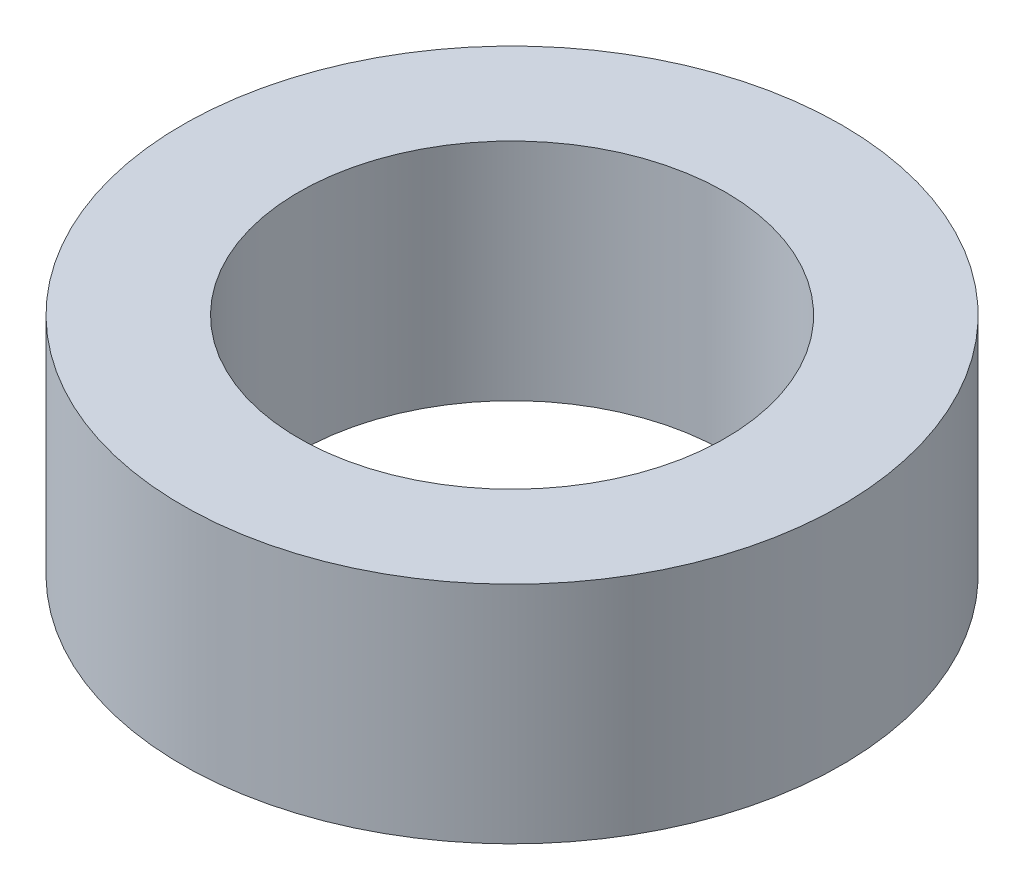
ISO-10303-21;
HEADER;
FILE_DESCRIPTION(('STEP AP214'),'2;1');
FILE_NAME('part.step','',(''),(''),'','','');
FILE_SCHEMA(('AUTOMOTIVE_DESIGN { 1 0 10303 214 1 1 1 1 }'));
ENDSEC;
DATA;
#1=APPLICATION_CONTEXT('core data for automotive mechanical design processes');
#2=APPLICATION_PROTOCOL_DEFINITION('international standard','automotive_design',2000,#1);
#3=PRODUCT_CONTEXT('',#1,'mechanical');
#4=PRODUCT('Part','Part','',(#3));
#5=PRODUCT_RELATED_PRODUCT_CATEGORY('part','',(#4));
#6=PRODUCT_DEFINITION_FORMATION('','',#4);
#7=PRODUCT_DEFINITION_CONTEXT('part definition',#1,'design');
#8=PRODUCT_DEFINITION('design','',#6,#7);
#9=PRODUCT_DEFINITION_SHAPE('','',#8);
#10=(LENGTH_UNIT() NAMED_UNIT(*) SI_UNIT(.MILLI.,.METRE.));
#11=(NAMED_UNIT(*) PLANE_ANGLE_UNIT() SI_UNIT($,.RADIAN.));
#12=(NAMED_UNIT(*) SI_UNIT($,.STERADIAN.) SOLID_ANGLE_UNIT());
#13=UNCERTAINTY_MEASURE_WITH_UNIT(LENGTH_MEASURE(1.E-05),#10,'distance_accuracy_value','');
#14=(GEOMETRIC_REPRESENTATION_CONTEXT(3) GLOBAL_UNCERTAINTY_ASSIGNED_CONTEXT((#13)) GLOBAL_UNIT_ASSIGNED_CONTEXT((#10,
#11,#12)) REPRESENTATION_CONTEXT('',''));
#15=CARTESIAN_POINT('',(0.,0.,0.));
#16=DIRECTION('',(0.,0.,1.));
#17=DIRECTION('',(1.,0.,0.));
#18=AXIS2_PLACEMENT_3D('',#15,#16,#17);
#19=CARTESIAN_POINT('',(0.,29.,0.));
#20=DIRECTION('',(0.,-1.,0.));
#21=DIRECTION('',(0.,0.,-1.));
#22=AXIS2_PLACEMENT_3D('',#19,#20,#21);
#23=CYLINDRICAL_SURFACE('',#22,42.5);
#24=CARTESIAN_POINT('',(0.,29.,0.));
#25=DIRECTION('',(0.,1.,0.));
#26=DIRECTION('',(0.,0.,1.));
#27=AXIS2_PLACEMENT_3D('',#24,#25,#26);
#28=CIRCLE('',#27,42.5);
#29=CARTESIAN_POINT('',(0.,29.,-42.5));
#30=VERTEX_POINT('',#29);
#31=EDGE_CURVE('E10',#30,#30,#28,.T.);
#32=CARTESIAN_POINT('',(0.,0.,0.));
#33=DIRECTION('',(0.,1.,0.));
#34=DIRECTION('',(0.,0.,1.));
#35=AXIS2_PLACEMENT_3D('',#32,#33,#34);
#36=CIRCLE('',#35,42.5);
#37=CARTESIAN_POINT('',(0.,0.,-42.5));
#38=VERTEX_POINT('',#37);
#39=EDGE_CURVE('E37',#38,#38,#36,.T.);
#40=CARTESIAN_POINT('',(0.,29.,-42.5));
#41=CARTESIAN_POINT('',(0.,28.6979166666667,-42.5));
#42=CARTESIAN_POINT('',(0.,28.3958333333333,-42.5));
#43=CARTESIAN_POINT('',(0.,27.7916666666667,-42.5));
#44=CARTESIAN_POINT('',(0.,27.4895833333333,-42.5));
#45=CARTESIAN_POINT('',(0.,26.8854166666667,-42.5));
#46=CARTESIAN_POINT('',(0.,26.5833333333333,-42.5));
#47=CARTESIAN_POINT('',(0.,25.9791666666667,-42.5));
#48=CARTESIAN_POINT('',(0.,25.6770833333333,-42.5));
#49=CARTESIAN_POINT('',(0.,25.0729166666667,-42.5));
#50=CARTESIAN_POINT('',(0.,24.7708333333333,-42.5));
#51=CARTESIAN_POINT('',(0.,24.1666666666667,-42.5));
#52=CARTESIAN_POINT('',(0.,23.8645833333333,-42.5));
#53=CARTESIAN_POINT('',(0.,23.2604166666667,-42.5));
#54=CARTESIAN_POINT('',(0.,22.9583333333333,-42.5));
#55=CARTESIAN_POINT('',(0.,22.3541666666667,-42.5));
#56=CARTESIAN_POINT('',(0.,22.0520833333333,-42.5));
#57=CARTESIAN_POINT('',(0.,21.4479166666667,-42.5));
#58=CARTESIAN_POINT('',(0.,21.1458333333333,-42.5));
#59=CARTESIAN_POINT('',(0.,20.5416666666667,-42.5));
#60=CARTESIAN_POINT('',(0.,20.2395833333333,-42.5));
#61=CARTESIAN_POINT('',(0.,19.6354166666667,-42.5));
#62=CARTESIAN_POINT('',(0.,19.3333333333333,-42.5));
#63=CARTESIAN_POINT('',(0.,18.7291666666667,-42.5));
#64=CARTESIAN_POINT('',(0.,18.4270833333333,-42.5));
#65=CARTESIAN_POINT('',(0.,17.8229166666667,-42.5));
#66=CARTESIAN_POINT('',(0.,17.5208333333333,-42.5));
#67=CARTESIAN_POINT('',(0.,16.9166666666667,-42.5));
#68=CARTESIAN_POINT('',(0.,16.6145833333333,-42.5));
#69=CARTESIAN_POINT('',(0.,16.0104166666667,-42.5));
#70=CARTESIAN_POINT('',(0.,15.7083333333333,-42.5));
#71=CARTESIAN_POINT('',(0.,15.1041666666667,-42.5));
#72=CARTESIAN_POINT('',(0.,14.8020833333333,-42.5));
#73=CARTESIAN_POINT('',(0.,14.1979166666667,-42.5));
#74=CARTESIAN_POINT('',(0.,13.8958333333333,-42.5));
#75=CARTESIAN_POINT('',(0.,13.2916666666667,-42.5));
#76=CARTESIAN_POINT('',(0.,12.9895833333333,-42.5));
#77=CARTESIAN_POINT('',(0.,12.3854166666667,-42.5));
#78=CARTESIAN_POINT('',(0.,12.0833333333333,-42.5));
#79=CARTESIAN_POINT('',(0.,11.4791666666667,-42.5));
#80=CARTESIAN_POINT('',(0.,11.1770833333333,-42.5));
#81=CARTESIAN_POINT('',(0.,10.5729166666667,-42.5));
#82=CARTESIAN_POINT('',(0.,10.2708333333333,-42.5));
#83=CARTESIAN_POINT('',(0.,9.66666666666667,-42.5));
#84=CARTESIAN_POINT('',(0.,9.36458333333333,-42.5));
#85=CARTESIAN_POINT('',(0.,8.76041666666667,-42.5));
#86=CARTESIAN_POINT('',(0.,8.45833333333333,-42.5));
#87=CARTESIAN_POINT('',(0.,7.85416666666667,-42.5));
#88=CARTESIAN_POINT('',(0.,7.55208333333333,-42.5));
#89=CARTESIAN_POINT('',(0.,6.94791666666667,-42.5));
#90=CARTESIAN_POINT('',(0.,6.64583333333333,-42.5));
#91=CARTESIAN_POINT('',(0.,6.04166666666667,-42.5));
#92=CARTESIAN_POINT('',(0.,5.73958333333333,-42.5));
#93=CARTESIAN_POINT('',(0.,5.13541666666667,-42.5));
#94=CARTESIAN_POINT('',(0.,4.83333333333333,-42.5));
#95=CARTESIAN_POINT('',(0.,4.22916666666667,-42.5));
#96=CARTESIAN_POINT('',(0.,3.92708333333333,-42.5));
#97=CARTESIAN_POINT('',(0.,3.32291666666667,-42.5));
#98=CARTESIAN_POINT('',(0.,3.02083333333333,-42.5));
#99=CARTESIAN_POINT('',(0.,2.41666666666667,-42.5));
#100=CARTESIAN_POINT('',(0.,2.11458333333333,-42.5));
#101=CARTESIAN_POINT('',(0.,1.51041666666667,-42.5));
#102=CARTESIAN_POINT('',(0.,1.20833333333333,-42.5));
#103=CARTESIAN_POINT('',(0.,0.604166666666667,-42.5));
#104=CARTESIAN_POINT('',(0.,0.302083333333333,-42.5));
#105=CARTESIAN_POINT('',(0.,0.,-42.5));
#106=B_SPLINE_CURVE_WITH_KNOTS('',3,(#40,#41,#42,#43,#44,#45,#46,#47,#48,#49,#50,#51,#52,#53,
#54,#55,#56,#57,#58,#59,#60,#61,#62,#63,#64,#65,#66,#67,#68,#69,#70,#71,#72,#73,#74,#75,#76,#77,
#78,#79,#80,#81,#82,#83,#84,#85,#86,#87,#88,#89,#90,#91,#92,#93,#94,#95,#96,#97,#98,#99,#100,
#101,#102,#103,#104,#105),.UNSPECIFIED.,.F.,.F.,(4,2,2,2,2,2,2,2,2,2,2,2,2,2,2,2,2,2,2,2,2,2,2,
2,2,2,2,2,2,2,2,2,4),(0.,0.906249999999997,1.8125,2.71875,3.625,4.53125,5.4375,6.34375,7.25,
8.15625,9.0625,9.96875,10.875,11.78125,12.6875,13.59375,14.5,15.40625,16.3125,17.21875,18.125,
19.03125,19.9375,20.84375,21.75,22.65625,23.5625,24.46875,25.375,26.28125,27.1875,28.09375,29.),.UNSPECIFIED.);
#107=EDGE_CURVE('BSEAM40',#30,#38,#106,.T.);
#108=ORIENTED_EDGE('',*,*,#31,.F.);
#109=ORIENTED_EDGE('',*,*,#39,.T.);
#110=ORIENTED_EDGE('',*,*,#107,.T.);
#111=ORIENTED_EDGE('',*,*,#107,.F.);
#112=EDGE_LOOP('',(#108,#110,#109,#111));
#113=FACE_BOUND('',#112,.T.);
#114=ADVANCED_FACE('F40',(#113),#23,.T.);
#115=CARTESIAN_POINT('',(0.,29.,0.));
#116=DIRECTION('',(0.,1.,0.));
#117=DIRECTION('',(0.,0.,1.));
#118=AXIS2_PLACEMENT_3D('',#115,#116,#117);
#119=PLANE('',#118);
#120=CARTESIAN_POINT('',(0.,29.,0.));
#121=DIRECTION('',(0.,1.,0.));
#122=DIRECTION('',(0.,0.,1.));
#123=AXIS2_PLACEMENT_3D('',#120,#121,#122);
#124=CIRCLE('',#123,27.5);
#125=CARTESIAN_POINT('',(0.,29.,-27.5));
#126=VERTEX_POINT('',#125);
#127=EDGE_CURVE('E50',#126,#126,#124,.T.);
#128=ORIENTED_EDGE('',*,*,#127,.F.);
#129=EDGE_LOOP('',(#128));
#130=FACE_BOUND('',#129,.T.);
#131=ORIENTED_EDGE('',*,*,#31,.T.);
#132=EDGE_LOOP('',(#131));
#133=FACE_BOUND('',#132,.T.);
#134=ADVANCED_FACE('F59',(#130,#133),#119,.T.);
#135=CARTESIAN_POINT('',(0.,0.,0.));
#136=DIRECTION('',(0.,1.,0.));
#137=DIRECTION('',(0.,0.,1.));
#138=AXIS2_PLACEMENT_3D('',#135,#136,#137);
#139=PLANE('',#138);
#140=CARTESIAN_POINT('',(0.,0.,0.));
#141=DIRECTION('',(0.,1.,0.));
#142=DIRECTION('',(0.,0.,1.));
#143=AXIS2_PLACEMENT_3D('',#140,#141,#142);
#144=CIRCLE('',#143,27.5);
#145=CARTESIAN_POINT('',(0.,0.,-27.5));
#146=VERTEX_POINT('',#145);
#147=EDGE_CURVE('E47',#146,#146,#144,.T.);
#148=ORIENTED_EDGE('',*,*,#147,.T.);
#149=EDGE_LOOP('',(#148));
#150=FACE_BOUND('',#149,.T.);
#151=ORIENTED_EDGE('',*,*,#39,.F.);
#152=EDGE_LOOP('',(#151));
#153=FACE_BOUND('',#152,.T.);
#154=ADVANCED_FACE('F58',(#150,#153),#139,.F.);
#155=CARTESIAN_POINT('',(0.,29.,0.));
#156=DIRECTION('',(0.,-1.,0.));
#157=DIRECTION('',(0.,0.,-1.));
#158=AXIS2_PLACEMENT_3D('',#155,#156,#157);
#159=CYLINDRICAL_SURFACE('',#158,27.5);
#160=CARTESIAN_POINT('',(0.,29.,-27.5));
#161=CARTESIAN_POINT('',(0.,28.6979166666667,-27.5));
#162=CARTESIAN_POINT('',(0.,28.3958333333333,-27.5));
#163=CARTESIAN_POINT('',(0.,27.7916666666667,-27.5));
#164=CARTESIAN_POINT('',(0.,27.4895833333333,-27.5));
#165=CARTESIAN_POINT('',(0.,26.8854166666667,-27.5));
#166=CARTESIAN_POINT('',(0.,26.5833333333333,-27.5));
#167=CARTESIAN_POINT('',(0.,25.9791666666667,-27.5));
#168=CARTESIAN_POINT('',(0.,25.6770833333333,-27.5));
#169=CARTESIAN_POINT('',(0.,25.0729166666667,-27.5));
#170=CARTESIAN_POINT('',(0.,24.7708333333333,-27.5));
#171=CARTESIAN_POINT('',(0.,24.1666666666667,-27.5));
#172=CARTESIAN_POINT('',(0.,23.8645833333333,-27.5));
#173=CARTESIAN_POINT('',(0.,23.2604166666667,-27.5));
#174=CARTESIAN_POINT('',(0.,22.9583333333333,-27.5));
#175=CARTESIAN_POINT('',(0.,22.3541666666667,-27.5));
#176=CARTESIAN_POINT('',(0.,22.0520833333333,-27.5));
#177=CARTESIAN_POINT('',(0.,21.4479166666667,-27.5));
#178=CARTESIAN_POINT('',(0.,21.1458333333333,-27.5));
#179=CARTESIAN_POINT('',(0.,20.5416666666667,-27.5));
#180=CARTESIAN_POINT('',(0.,20.2395833333333,-27.5));
#181=CARTESIAN_POINT('',(0.,19.6354166666667,-27.5));
#182=CARTESIAN_POINT('',(0.,19.3333333333333,-27.5));
#183=CARTESIAN_POINT('',(0.,18.7291666666667,-27.5));
#184=CARTESIAN_POINT('',(0.,18.4270833333333,-27.5));
#185=CARTESIAN_POINT('',(0.,17.8229166666667,-27.5));
#186=CARTESIAN_POINT('',(0.,17.5208333333333,-27.5));
#187=CARTESIAN_POINT('',(0.,16.9166666666667,-27.5));
#188=CARTESIAN_POINT('',(0.,16.6145833333333,-27.5));
#189=CARTESIAN_POINT('',(0.,16.0104166666667,-27.5));
#190=CARTESIAN_POINT('',(0.,15.7083333333333,-27.5));
#191=CARTESIAN_POINT('',(0.,15.1041666666667,-27.5));
#192=CARTESIAN_POINT('',(0.,14.8020833333333,-27.5));
#193=CARTESIAN_POINT('',(0.,14.1979166666667,-27.5));
#194=CARTESIAN_POINT('',(0.,13.8958333333333,-27.5));
#195=CARTESIAN_POINT('',(0.,13.2916666666667,-27.5));
#196=CARTESIAN_POINT('',(0.,12.9895833333333,-27.5));
#197=CARTESIAN_POINT('',(0.,12.3854166666667,-27.5));
#198=CARTESIAN_POINT('',(0.,12.0833333333333,-27.5));
#199=CARTESIAN_POINT('',(0.,11.4791666666667,-27.5));
#200=CARTESIAN_POINT('',(0.,11.1770833333333,-27.5));
#201=CARTESIAN_POINT('',(0.,10.5729166666667,-27.5));
#202=CARTESIAN_POINT('',(0.,10.2708333333333,-27.5));
#203=CARTESIAN_POINT('',(0.,9.66666666666667,-27.5));
#204=CARTESIAN_POINT('',(0.,9.36458333333333,-27.5));
#205=CARTESIAN_POINT('',(0.,8.76041666666667,-27.5));
#206=CARTESIAN_POINT('',(0.,8.45833333333333,-27.5));
#207=CARTESIAN_POINT('',(0.,7.85416666666667,-27.5));
#208=CARTESIAN_POINT('',(0.,7.55208333333333,-27.5));
#209=CARTESIAN_POINT('',(0.,6.94791666666667,-27.5));
#210=CARTESIAN_POINT('',(0.,6.64583333333333,-27.5));
#211=CARTESIAN_POINT('',(0.,6.04166666666667,-27.5));
#212=CARTESIAN_POINT('',(0.,5.73958333333333,-27.5));
#213=CARTESIAN_POINT('',(0.,5.13541666666667,-27.5));
#214=CARTESIAN_POINT('',(0.,4.83333333333333,-27.5));
#215=CARTESIAN_POINT('',(0.,4.22916666666667,-27.5));
#216=CARTESIAN_POINT('',(0.,3.92708333333333,-27.5));
#217=CARTESIAN_POINT('',(0.,3.32291666666667,-27.5));
#218=CARTESIAN_POINT('',(0.,3.02083333333333,-27.5));
#219=CARTESIAN_POINT('',(0.,2.41666666666667,-27.5));
#220=CARTESIAN_POINT('',(0.,2.11458333333333,-27.5));
#221=CARTESIAN_POINT('',(0.,1.51041666666667,-27.5));
#222=CARTESIAN_POINT('',(0.,1.20833333333333,-27.5));
#223=CARTESIAN_POINT('',(0.,0.604166666666667,-27.5));
#224=CARTESIAN_POINT('',(0.,0.302083333333333,-27.5));
#225=CARTESIAN_POINT('',(0.,0.,-27.5));
#226=B_SPLINE_CURVE_WITH_KNOTS('',3,(#160,#161,#162,#163,#164,#165,#166,#167,#168,#169,#170,
#171,#172,#173,#174,#175,#176,#177,#178,#179,#180,#181,#182,#183,#184,#185,#186,#187,#188,#189,
#190,#191,#192,#193,#194,#195,#196,#197,#198,#199,#200,#201,#202,#203,#204,#205,#206,#207,#208,
#209,#210,#211,#212,#213,#214,#215,#216,#217,#218,#219,#220,#221,#222,#223,#224,#225),
.UNSPECIFIED.,.F.,.F.,(4,2,2,2,2,2,2,2,2,2,2,2,2,2,2,2,2,2,2,2,2,2,2,2,2,2,2,2,2,2,2,2,4),(0.,
0.906249999999997,1.8125,2.71875,3.625,4.53125,5.4375,6.34375,7.25,8.15625,9.0625,9.96875,
10.875,11.78125,12.6875,13.59375,14.5,15.40625,16.3125,17.21875,18.125,19.03125,19.9375,
20.84375,21.75,22.65625,23.5625,24.46875,25.375,26.28125,27.1875,28.09375,29.),.UNSPECIFIED.);
#227=EDGE_CURVE('BSEAM54',#126,#146,#226,.T.);
#228=ORIENTED_EDGE('',*,*,#127,.T.);
#229=ORIENTED_EDGE('',*,*,#147,.F.);
#230=ORIENTED_EDGE('',*,*,#227,.T.);
#231=ORIENTED_EDGE('',*,*,#227,.F.);
#232=EDGE_LOOP('',(#228,#230,#229,#231));
#233=FACE_BOUND('',#232,.T.);
#234=ADVANCED_FACE('F54',(#233),#159,.F.);
#235=CLOSED_SHELL('',(#114,#134,#154,#234));
#236=MANIFOLD_SOLID_BREP('B2',#235);
#237=ADVANCED_BREP_SHAPE_REPRESENTATION('',(#18,#236),#14);
#238=SHAPE_DEFINITION_REPRESENTATION(#9,#237);
ENDSEC;
END-ISO-10303-21;
